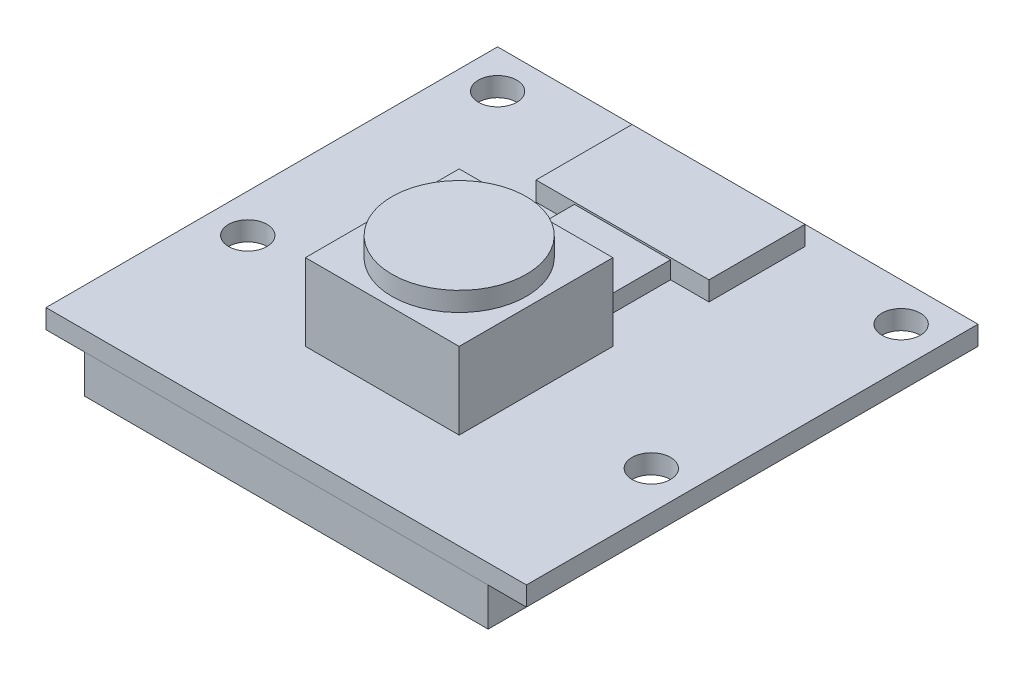
ISO-10303-21;
HEADER;
FILE_DESCRIPTION(('STEP AP214'),'2;1');
FILE_NAME('part.step','',(''),(''),'','','');
FILE_SCHEMA(('AUTOMOTIVE_DESIGN { 1 0 10303 214 1 1 1 1 }'));
ENDSEC;
DATA;
#1=APPLICATION_CONTEXT('core data for automotive mechanical design processes');
#2=APPLICATION_PROTOCOL_DEFINITION('international standard','automotive_design',2000,#1);
#3=PRODUCT_CONTEXT('',#1,'mechanical');
#4=PRODUCT('Part','Part','',(#3));
#5=PRODUCT_RELATED_PRODUCT_CATEGORY('part','',(#4));
#6=PRODUCT_DEFINITION_FORMATION('','',#4);
#7=PRODUCT_DEFINITION_CONTEXT('part definition',#1,'design');
#8=PRODUCT_DEFINITION('design','',#6,#7);
#9=PRODUCT_DEFINITION_SHAPE('','',#8);
#10=(LENGTH_UNIT() NAMED_UNIT(*) SI_UNIT(.MILLI.,.METRE.));
#11=(NAMED_UNIT(*) PLANE_ANGLE_UNIT() SI_UNIT($,.RADIAN.));
#12=(NAMED_UNIT(*) SI_UNIT($,.STERADIAN.) SOLID_ANGLE_UNIT());
#13=UNCERTAINTY_MEASURE_WITH_UNIT(LENGTH_MEASURE(1.E-05),#10,'distance_accuracy_value','');
#14=(GEOMETRIC_REPRESENTATION_CONTEXT(3) GLOBAL_UNCERTAINTY_ASSIGNED_CONTEXT((#13)) GLOBAL_UNIT_ASSIGNED_CONTEXT((#10,
#11,#12)) REPRESENTATION_CONTEXT('',''));
#15=CARTESIAN_POINT('',(0.,0.,0.));
#16=DIRECTION('',(0.,0.,1.));
#17=DIRECTION('',(1.,0.,0.));
#18=AXIS2_PLACEMENT_3D('',#15,#16,#17);
#19=CARTESIAN_POINT('',(0.,0.,0.));
#20=DIRECTION('',(0.,1.,0.));
#21=DIRECTION('',(0.,0.,1.));
#22=AXIS2_PLACEMENT_3D('',#19,#20,#21);
#23=PLANE('',#22);
#24=DIRECTION('',(0.,0.,-1.));
#25=VECTOR('',#24,1.);
#26=CARTESIAN_POINT('',(12.5,0.,-11.75));
#27=LINE('',#26,#25);
#28=CARTESIAN_POINT('',(12.5,0.,11.75));
#29=VERTEX_POINT('',#28);
#30=CARTESIAN_POINT('',(12.5,0.,-11.75));
#31=VERTEX_POINT('',#30);
#32=EDGE_CURVE('E310',#29,#31,#27,.T.);
#33=ORIENTED_EDGE('',*,*,#32,.F.);
#34=DIRECTION('',(1.,0.,0.));
#35=VECTOR('',#34,1.);
#36=CARTESIAN_POINT('',(-12.5,0.,11.75));
#37=LINE('',#36,#35);
#38=CARTESIAN_POINT('',(-12.5,0.,11.75));
#39=VERTEX_POINT('',#38);
#40=EDGE_CURVE('E317',#39,#29,#37,.T.);
#41=ORIENTED_EDGE('',*,*,#40,.F.);
#42=DIRECTION('',(0.,0.,1.));
#43=VECTOR('',#42,1.);
#44=CARTESIAN_POINT('',(-12.5,0.,-11.75));
#45=LINE('',#44,#43);
#46=CARTESIAN_POINT('',(-12.5,0.,-11.75));
#47=VERTEX_POINT('',#46);
#48=EDGE_CURVE('E328',#47,#39,#45,.T.);
#49=ORIENTED_EDGE('',*,*,#48,.F.);
#50=DIRECTION('',(-1.,0.,0.));
#51=VECTOR('',#50,1.);
#52=CARTESIAN_POINT('',(-12.5,0.,-11.75));
#53=LINE('',#52,#51);
#54=EDGE_CURVE('E326',#31,#47,#53,.T.);
#55=ORIENTED_EDGE('',*,*,#54,.F.);
#56=EDGE_LOOP('',(#33,#41,#49,#55));
#57=FACE_BOUND('',#56,.T.);
#58=CARTESIAN_POINT('',(-10.5,0.,-9.75));
#59=DIRECTION('',(0.,1.,0.));
#60=DIRECTION('',(0.,0.,1.));
#61=AXIS2_PLACEMENT_3D('',#58,#59,#60);
#62=CIRCLE('',#61,1.);
#63=CARTESIAN_POINT('',(-10.5,0.,-8.75));
#64=VERTEX_POINT('',#63);
#65=EDGE_CURVE('E307',#64,#64,#62,.T.);
#66=ORIENTED_EDGE('',*,*,#65,.T.);
#67=EDGE_LOOP('',(#66));
#68=FACE_BOUND('',#67,.T.);
#69=CARTESIAN_POINT('',(10.5,0.,-9.75));
#70=DIRECTION('',(0.,1.,0.));
#71=DIRECTION('',(0.,0.,1.));
#72=AXIS2_PLACEMENT_3D('',#69,#70,#71);
#73=CIRCLE('',#72,1.);
#74=CARTESIAN_POINT('',(10.5,0.,-8.75));
#75=VERTEX_POINT('',#74);
#76=EDGE_CURVE('E301',#75,#75,#73,.T.);
#77=ORIENTED_EDGE('',*,*,#76,.T.);
#78=EDGE_LOOP('',(#77));
#79=FACE_BOUND('',#78,.T.);
#80=CARTESIAN_POINT('',(10.5,0.,3.25));
#81=DIRECTION('',(0.,1.,0.));
#82=DIRECTION('',(0.,0.,1.));
#83=AXIS2_PLACEMENT_3D('',#80,#81,#82);
#84=CIRCLE('',#83,1.);
#85=CARTESIAN_POINT('',(10.5,0.,4.25));
#86=VERTEX_POINT('',#85);
#87=EDGE_CURVE('E295',#86,#86,#84,.T.);
#88=ORIENTED_EDGE('',*,*,#87,.T.);
#89=EDGE_LOOP('',(#88));
#90=FACE_BOUND('',#89,.T.);
#91=CARTESIAN_POINT('',(-10.5,0.,3.25));
#92=DIRECTION('',(0.,1.,0.));
#93=DIRECTION('',(0.,0.,1.));
#94=AXIS2_PLACEMENT_3D('',#91,#92,#93);
#95=CIRCLE('',#94,1.);
#96=CARTESIAN_POINT('',(-10.5,0.,4.25));
#97=VERTEX_POINT('',#96);
#98=EDGE_CURVE('E289',#97,#97,#95,.T.);
#99=ORIENTED_EDGE('',*,*,#98,.T.);
#100=EDGE_LOOP('',(#99));
#101=FACE_BOUND('',#100,.T.);
#102=DIRECTION('',(0.,0.,1.));
#103=VECTOR('',#102,1.);
#104=CARTESIAN_POINT('',(10.5,0.,11.74));
#105=LINE('',#104,#103);
#106=CARTESIAN_POINT('',(10.5,0.,6.74));
#107=VERTEX_POINT('',#106);
#108=CARTESIAN_POINT('',(10.5,0.,11.74));
#109=VERTEX_POINT('',#108);
#110=EDGE_CURVE('E189',#107,#109,#105,.T.);
#111=ORIENTED_EDGE('',*,*,#110,.F.);
#112=DIRECTION('',(1.,0.,0.));
#113=VECTOR('',#112,1.);
#114=CARTESIAN_POINT('',(-10.5,0.,6.74));
#115=LINE('',#114,#113);
#116=CARTESIAN_POINT('',(-10.5,0.,6.74));
#117=VERTEX_POINT('',#116);
#118=EDGE_CURVE('E186',#117,#107,#115,.T.);
#119=ORIENTED_EDGE('',*,*,#118,.F.);
#120=DIRECTION('',(0.,0.,-1.));
#121=VECTOR('',#120,1.);
#122=CARTESIAN_POINT('',(-10.5,0.,11.74));
#123=LINE('',#122,#121);
#124=CARTESIAN_POINT('',(-10.5,0.,11.74));
#125=VERTEX_POINT('',#124);
#126=EDGE_CURVE('E52',#125,#117,#123,.T.);
#127=ORIENTED_EDGE('',*,*,#126,.F.);
#128=DIRECTION('',(-1.,0.,0.));
#129=VECTOR('',#128,1.);
#130=CARTESIAN_POINT('',(-10.5,0.,11.74));
#131=LINE('',#130,#129);
#132=EDGE_CURVE('E47',#109,#125,#131,.T.);
#133=ORIENTED_EDGE('',*,*,#132,.F.);
#134=EDGE_LOOP('',(#111,#119,#127,#133));
#135=FACE_BOUND('',#134,.T.);
#136=ADVANCED_FACE('F32',(#57,#68,#79,#90,#101,#135),#23,.F.);
#137=CARTESIAN_POINT('',(0.,5.,0.));
#138=DIRECTION('',(0.,1.,0.));
#139=DIRECTION('',(0.,0.,1.));
#140=AXIS2_PLACEMENT_3D('',#137,#138,#139);
#141=PLANE('',#140);
#142=DIRECTION('',(0.,0.,-1.));
#143=VECTOR('',#142,1.);
#144=CARTESIAN_POINT('',(4.,5.,-1.25));
#145=LINE('',#144,#143);
#146=CARTESIAN_POINT('',(4.,5.,6.75));
#147=VERTEX_POINT('',#146);
#148=CARTESIAN_POINT('',(4.,5.,-1.25));
#149=VERTEX_POINT('',#148);
#150=EDGE_CURVE('E202',#147,#149,#145,.T.);
#151=ORIENTED_EDGE('',*,*,#150,.T.);
#152=DIRECTION('',(-1.,0.,0.));
#153=VECTOR('',#152,1.);
#154=CARTESIAN_POINT('',(-4.,5.,-1.25));
#155=LINE('',#154,#153);
#156=CARTESIAN_POINT('',(-4.,5.,-1.25));
#157=VERTEX_POINT('',#156);
#158=EDGE_CURVE('E205',#149,#157,#155,.T.);
#159=ORIENTED_EDGE('',*,*,#158,.T.);
#160=DIRECTION('',(0.,0.,1.));
#161=VECTOR('',#160,1.);
#162=CARTESIAN_POINT('',(-4.,5.,-1.25));
#163=LINE('',#162,#161);
#164=CARTESIAN_POINT('',(-4.,5.,6.75));
#165=VERTEX_POINT('',#164);
#166=EDGE_CURVE('E208',#157,#165,#163,.T.);
#167=ORIENTED_EDGE('',*,*,#166,.T.);
#168=DIRECTION('',(1.,0.,0.));
#169=VECTOR('',#168,1.);
#170=CARTESIAN_POINT('',(-4.,5.,6.75));
#171=LINE('',#170,#169);
#172=EDGE_CURVE('E210',#165,#147,#171,.T.);
#173=ORIENTED_EDGE('',*,*,#172,.T.);
#174=EDGE_LOOP('',(#151,#159,#167,#173));
#175=FACE_BOUND('',#174,.T.);
#176=CARTESIAN_POINT('',(0.,5.,2.75));
#177=DIRECTION('',(0.,1.,0.));
#178=DIRECTION('',(0.,0.,1.));
#179=AXIS2_PLACEMENT_3D('',#176,#177,#178);
#180=CIRCLE('',#179,3.5);
#181=CARTESIAN_POINT('',(0.,5.,6.25));
#182=VERTEX_POINT('',#181);
#183=EDGE_CURVE('E190',#182,#182,#180,.T.);
#184=ORIENTED_EDGE('',*,*,#183,.F.);
#185=EDGE_LOOP('',(#184));
#186=FACE_BOUND('',#185,.T.);
#187=ADVANCED_FACE('F366',(#175,#186),#141,.T.);
#188=CARTESIAN_POINT('',(0.,1.,0.));
#189=DIRECTION('',(0.,1.,0.));
#190=DIRECTION('',(0.,0.,1.));
#191=AXIS2_PLACEMENT_3D('',#188,#189,#190);
#192=PLANE('',#191);
#193=DIRECTION('',(0.,0.,-1.));
#194=VECTOR('',#193,1.);
#195=CARTESIAN_POINT('',(12.5,1.,-11.75));
#196=LINE('',#195,#194);
#197=CARTESIAN_POINT('',(12.5,1.,11.75));
#198=VERTEX_POINT('',#197);
#199=CARTESIAN_POINT('',(12.5,1.,-11.75));
#200=VERTEX_POINT('',#199);
#201=EDGE_CURVE('E313',#198,#200,#196,.T.);
#202=ORIENTED_EDGE('',*,*,#201,.T.);
#203=DIRECTION('',(-1.,0.,0.));
#204=VECTOR('',#203,1.);
#205=CARTESIAN_POINT('',(-12.5,1.,-11.75));
#206=LINE('',#205,#204);
#207=CARTESIAN_POINT('',(-12.5,1.,-11.75));
#208=VERTEX_POINT('',#207);
#209=EDGE_CURVE('E316',#200,#208,#206,.T.);
#210=ORIENTED_EDGE('',*,*,#209,.T.);
#211=DIRECTION('',(0.,0.,1.));
#212=VECTOR('',#211,1.);
#213=CARTESIAN_POINT('',(-12.5,1.,-11.75));
#214=LINE('',#213,#212);
#215=CARTESIAN_POINT('',(-12.5,1.,11.75));
#216=VERTEX_POINT('',#215);
#217=EDGE_CURVE('E319',#208,#216,#214,.T.);
#218=ORIENTED_EDGE('',*,*,#217,.T.);
#219=DIRECTION('',(1.,0.,0.));
#220=VECTOR('',#219,1.);
#221=CARTESIAN_POINT('',(-12.5,1.,11.75));
#222=LINE('',#221,#220);
#223=EDGE_CURVE('E321',#216,#198,#222,.T.);
#224=ORIENTED_EDGE('',*,*,#223,.T.);
#225=EDGE_LOOP('',(#202,#210,#218,#224));
#226=FACE_BOUND('',#225,.T.);
#227=CARTESIAN_POINT('',(-10.5,1.,-9.75));
#228=DIRECTION('',(0.,1.,0.));
#229=DIRECTION('',(0.,0.,1.));
#230=AXIS2_PLACEMENT_3D('',#227,#228,#229);
#231=CIRCLE('',#230,1.);
#232=CARTESIAN_POINT('',(-10.5,1.,-8.75));
#233=VERTEX_POINT('',#232);
#234=EDGE_CURVE('E304',#233,#233,#231,.T.);
#235=ORIENTED_EDGE('',*,*,#234,.F.);
#236=EDGE_LOOP('',(#235));
#237=FACE_BOUND('',#236,.T.);
#238=CARTESIAN_POINT('',(10.5,1.,-9.75));
#239=DIRECTION('',(0.,1.,0.));
#240=DIRECTION('',(0.,0.,1.));
#241=AXIS2_PLACEMENT_3D('',#238,#239,#240);
#242=CIRCLE('',#241,1.);
#243=CARTESIAN_POINT('',(10.5,1.,-8.75));
#244=VERTEX_POINT('',#243);
#245=EDGE_CURVE('E298',#244,#244,#242,.T.);
#246=ORIENTED_EDGE('',*,*,#245,.F.);
#247=EDGE_LOOP('',(#246));
#248=FACE_BOUND('',#247,.T.);
#249=CARTESIAN_POINT('',(10.5,1.,3.25));
#250=DIRECTION('',(0.,1.,0.));
#251=DIRECTION('',(0.,0.,1.));
#252=AXIS2_PLACEMENT_3D('',#249,#250,#251);
#253=CIRCLE('',#252,1.);
#254=CARTESIAN_POINT('',(10.5,1.,4.25));
#255=VERTEX_POINT('',#254);
#256=EDGE_CURVE('E292',#255,#255,#253,.T.);
#257=ORIENTED_EDGE('',*,*,#256,.F.);
#258=EDGE_LOOP('',(#257));
#259=FACE_BOUND('',#258,.T.);
#260=CARTESIAN_POINT('',(-10.5,1.,3.25));
#261=DIRECTION('',(0.,1.,0.));
#262=DIRECTION('',(0.,0.,1.));
#263=AXIS2_PLACEMENT_3D('',#260,#261,#262);
#264=CIRCLE('',#263,1.);
#265=CARTESIAN_POINT('',(-10.5,1.,4.25));
#266=VERTEX_POINT('',#265);
#267=EDGE_CURVE('E288',#266,#266,#264,.T.);
#268=ORIENTED_EDGE('',*,*,#267,.F.);
#269=EDGE_LOOP('',(#268));
#270=FACE_BOUND('',#269,.T.);
#271=DIRECTION('',(0.,0.,-1.));
#272=VECTOR('',#271,1.);
#273=CARTESIAN_POINT('',(2.5,1.,-5.75));
#274=LINE('',#273,#272);
#275=CARTESIAN_POINT('',(2.5,1.,-1.25));
#276=VERTEX_POINT('',#275);
#277=CARTESIAN_POINT('',(2.5,1.,-5.75));
#278=VERTEX_POINT('',#277);
#279=EDGE_CURVE('E231',#276,#278,#274,.T.);
#280=ORIENTED_EDGE('',*,*,#279,.F.);
#281=DIRECTION('',(-1.,0.,0.));
#282=VECTOR('',#281,1.);
#283=CARTESIAN_POINT('',(-4.,1.,-1.25));
#284=LINE('',#283,#282);
#285=CARTESIAN_POINT('',(4.,1.,-1.25));
#286=VERTEX_POINT('',#285);
#287=EDGE_CURVE('E216',#286,#276,#284,.T.);
#288=ORIENTED_EDGE('',*,*,#287,.F.);
#289=DIRECTION('',(0.,0.,-1.));
#290=VECTOR('',#289,1.);
#291=CARTESIAN_POINT('',(4.,1.,-1.25));
#292=LINE('',#291,#290);
#293=CARTESIAN_POINT('',(4.,1.,6.75));
#294=VERTEX_POINT('',#293);
#295=EDGE_CURVE('E200',#294,#286,#292,.T.);
#296=ORIENTED_EDGE('',*,*,#295,.F.);
#297=DIRECTION('',(1.,0.,0.));
#298=VECTOR('',#297,1.);
#299=CARTESIAN_POINT('',(-4.,1.,6.75));
#300=LINE('',#299,#298);
#301=CARTESIAN_POINT('',(-4.,1.,6.75));
#302=VERTEX_POINT('',#301);
#303=EDGE_CURVE('E206',#302,#294,#300,.T.);
#304=ORIENTED_EDGE('',*,*,#303,.F.);
#305=DIRECTION('',(0.,0.,1.));
#306=VECTOR('',#305,1.);
#307=CARTESIAN_POINT('',(-4.,1.,-1.25));
#308=LINE('',#307,#306);
#309=CARTESIAN_POINT('',(-4.,1.,-1.25));
#310=VERTEX_POINT('',#309);
#311=EDGE_CURVE('E218',#310,#302,#308,.T.);
#312=ORIENTED_EDGE('',*,*,#311,.F.);
#313=CARTESIAN_POINT('',(-2.5,1.,-1.25));
#314=VERTEX_POINT('',#313);
#315=EDGE_CURVE('E215',#314,#310,#284,.T.);
#316=ORIENTED_EDGE('',*,*,#315,.F.);
#317=DIRECTION('',(0.,0.,1.));
#318=VECTOR('',#317,1.);
#319=CARTESIAN_POINT('',(-2.5,1.,-5.75));
#320=LINE('',#319,#318);
#321=CARTESIAN_POINT('',(-2.5,1.,-5.75));
#322=VERTEX_POINT('',#321);
#323=EDGE_CURVE('E236',#322,#314,#320,.T.);
#324=ORIENTED_EDGE('',*,*,#323,.F.);
#325=DIRECTION('',(1.,0.,0.));
#326=VECTOR('',#325,1.);
#327=CARTESIAN_POINT('',(-4.5,1.,-5.75));
#328=LINE('',#327,#326);
#329=CARTESIAN_POINT('',(-4.5,1.,-5.75));
#330=VERTEX_POINT('',#329);
#331=EDGE_CURVE('E262',#330,#322,#328,.T.);
#332=ORIENTED_EDGE('',*,*,#331,.F.);
#333=DIRECTION('',(0.,0.,1.));
#334=VECTOR('',#333,1.);
#335=CARTESIAN_POINT('',(-4.5,1.,-10.75));
#336=LINE('',#335,#334);
#337=CARTESIAN_POINT('',(-4.5,1.,-10.75));
#338=VERTEX_POINT('',#337);
#339=EDGE_CURVE('E273',#338,#330,#336,.T.);
#340=ORIENTED_EDGE('',*,*,#339,.F.);
#341=DIRECTION('',(-1.,0.,0.));
#342=VECTOR('',#341,1.);
#343=CARTESIAN_POINT('',(-4.5,1.,-10.75));
#344=LINE('',#343,#342);
#345=CARTESIAN_POINT('',(4.5,1.,-10.75));
#346=VERTEX_POINT('',#345);
#347=EDGE_CURVE('E271',#346,#338,#344,.T.);
#348=ORIENTED_EDGE('',*,*,#347,.F.);
#349=DIRECTION('',(0.,0.,-1.));
#350=VECTOR('',#349,1.);
#351=CARTESIAN_POINT('',(4.5,1.,-10.75));
#352=LINE('',#351,#350);
#353=CARTESIAN_POINT('',(4.5,1.,-5.75));
#354=VERTEX_POINT('',#353);
#355=EDGE_CURVE('E257',#354,#346,#352,.T.);
#356=ORIENTED_EDGE('',*,*,#355,.F.);
#357=EDGE_CURVE('E276',#278,#354,#328,.T.);
#358=ORIENTED_EDGE('',*,*,#357,.F.);
#359=EDGE_LOOP('',(#280,#288,#296,#304,#312,#316,#324,#332,#340,#348,#356,#358));
#360=FACE_BOUND('',#359,.T.);
#361=ADVANCED_FACE('F355',(#226,#237,#248,#259,#270,#360),#192,.T.);
#362=CARTESIAN_POINT('',(-4.5,2.,-5.75));
#363=DIRECTION('',(0.,0.,-1.));
#364=DIRECTION('',(-1.,0.,0.));
#365=AXIS2_PLACEMENT_3D('',#362,#363,#364);
#366=PLANE('',#365);
#367=DIRECTION('',(0.,-1.,0.));
#368=VECTOR('',#367,1.);
#369=CARTESIAN_POINT('',(2.5,1.9,-5.75));
#370=LINE('',#369,#368);
#371=CARTESIAN_POINT('',(2.5,1.9,-5.75));
#372=VERTEX_POINT('',#371);
#373=EDGE_CURVE('E254',#372,#278,#370,.T.);
#374=ORIENTED_EDGE('',*,*,#373,.T.);
#375=ORIENTED_EDGE('',*,*,#357,.T.);
#376=DIRECTION('',(0.,-1.,0.));
#377=VECTOR('',#376,1.);
#378=CARTESIAN_POINT('',(4.5,2.,-5.75));
#379=LINE('',#378,#377);
#380=CARTESIAN_POINT('',(4.5,2.,-5.75));
#381=VERTEX_POINT('',#380);
#382=EDGE_CURVE('E268',#381,#354,#379,.T.);
#383=ORIENTED_EDGE('',*,*,#382,.F.);
#384=DIRECTION('',(1.,0.,0.));
#385=VECTOR('',#384,1.);
#386=CARTESIAN_POINT('',(-4.5,2.,-5.75));
#387=LINE('',#386,#385);
#388=CARTESIAN_POINT('',(-4.5,2.,-5.75));
#389=VERTEX_POINT('',#388);
#390=EDGE_CURVE('E266',#389,#381,#387,.T.);
#391=ORIENTED_EDGE('',*,*,#390,.F.);
#392=DIRECTION('',(0.,-1.,0.));
#393=VECTOR('',#392,1.);
#394=CARTESIAN_POINT('',(-4.5,2.,-5.75));
#395=LINE('',#394,#393);
#396=EDGE_CURVE('E281',#389,#330,#395,.T.);
#397=ORIENTED_EDGE('',*,*,#396,.T.);
#398=ORIENTED_EDGE('',*,*,#331,.T.);
#399=DIRECTION('',(0.,-1.,0.));
#400=VECTOR('',#399,1.);
#401=CARTESIAN_POINT('',(-2.5,1.9,-5.75));
#402=LINE('',#401,#400);
#403=CARTESIAN_POINT('',(-2.5,1.9,-5.75));
#404=VERTEX_POINT('',#403);
#405=EDGE_CURVE('E252',#404,#322,#402,.T.);
#406=ORIENTED_EDGE('',*,*,#405,.F.);
#407=DIRECTION('',(-1.,0.,0.));
#408=VECTOR('',#407,1.);
#409=CARTESIAN_POINT('',(-2.5,1.9,-5.75));
#410=LINE('',#409,#408);
#411=EDGE_CURVE('E235',#372,#404,#410,.T.);
#412=ORIENTED_EDGE('',*,*,#411,.F.);
#413=EDGE_LOOP('',(#374,#375,#383,#391,#397,#398,#406,#412));
#414=FACE_BOUND('',#413,.T.);
#415=ADVANCED_FACE('F364',(#414),#366,.F.);
#416=CARTESIAN_POINT('',(12.5,1.,-11.75));
#417=DIRECTION('',(-1.,0.,0.));
#418=DIRECTION('',(0.,0.,1.));
#419=AXIS2_PLACEMENT_3D('',#416,#417,#418);
#420=PLANE('',#419);
#421=ORIENTED_EDGE('',*,*,#32,.T.);
#422=DIRECTION('',(0.,-1.,0.));
#423=VECTOR('',#422,1.);
#424=CARTESIAN_POINT('',(12.5,1.,-11.75));
#425=LINE('',#424,#423);
#426=EDGE_CURVE('E11',#200,#31,#425,.T.);
#427=ORIENTED_EDGE('',*,*,#426,.F.);
#428=ORIENTED_EDGE('',*,*,#201,.F.);
#429=DIRECTION('',(0.,-1.,0.));
#430=VECTOR('',#429,1.);
#431=CARTESIAN_POINT('',(12.5,1.,11.75));
#432=LINE('',#431,#430);
#433=EDGE_CURVE('E323',#198,#29,#432,.T.);
#434=ORIENTED_EDGE('',*,*,#433,.T.);
#435=EDGE_LOOP('',(#421,#427,#428,#434));
#436=FACE_BOUND('',#435,.T.);
#437=ADVANCED_FACE('F34',(#436),#420,.F.);
#438=CARTESIAN_POINT('',(-12.5,1.,-11.75));
#439=DIRECTION('',(0.,0.,1.));
#440=DIRECTION('',(1.,0.,0.));
#441=AXIS2_PLACEMENT_3D('',#438,#439,#440);
#442=PLANE('',#441);
#443=ORIENTED_EDGE('',*,*,#54,.T.);
#444=DIRECTION('',(0.,-1.,0.));
#445=VECTOR('',#444,1.);
#446=CARTESIAN_POINT('',(-12.5,1.,-11.75));
#447=LINE('',#446,#445);
#448=EDGE_CURVE('E40',#208,#47,#447,.T.);
#449=ORIENTED_EDGE('',*,*,#448,.F.);
#450=ORIENTED_EDGE('',*,*,#209,.F.);
#451=ORIENTED_EDGE('',*,*,#426,.T.);
#452=EDGE_LOOP('',(#443,#449,#450,#451));
#453=FACE_BOUND('',#452,.T.);
#454=ADVANCED_FACE('F357',(#453),#442,.F.);
#455=CARTESIAN_POINT('',(-12.5,1.,-11.75));
#456=DIRECTION('',(1.,0.,0.));
#457=DIRECTION('',(0.,0.,-1.));
#458=AXIS2_PLACEMENT_3D('',#455,#456,#457);
#459=PLANE('',#458);
#460=ORIENTED_EDGE('',*,*,#48,.T.);
#461=DIRECTION('',(0.,-1.,0.));
#462=VECTOR('',#461,1.);
#463=CARTESIAN_POINT('',(-12.5,1.,11.75));
#464=LINE('',#463,#462);
#465=EDGE_CURVE('E333',#216,#39,#464,.T.);
#466=ORIENTED_EDGE('',*,*,#465,.F.);
#467=ORIENTED_EDGE('',*,*,#217,.F.);
#468=ORIENTED_EDGE('',*,*,#448,.T.);
#469=EDGE_LOOP('',(#460,#466,#467,#468));
#470=FACE_BOUND('',#469,.T.);
#471=ADVANCED_FACE('F340',(#470),#459,.F.);
#472=CARTESIAN_POINT('',(-12.5,1.,11.75));
#473=DIRECTION('',(0.,0.,-1.));
#474=DIRECTION('',(-1.,0.,0.));
#475=AXIS2_PLACEMENT_3D('',#472,#473,#474);
#476=PLANE('',#475);
#477=ORIENTED_EDGE('',*,*,#40,.T.);
#478=ORIENTED_EDGE('',*,*,#433,.F.);
#479=ORIENTED_EDGE('',*,*,#223,.F.);
#480=ORIENTED_EDGE('',*,*,#465,.T.);
#481=EDGE_LOOP('',(#477,#478,#479,#480));
#482=FACE_BOUND('',#481,.T.);
#483=ADVANCED_FACE('F349',(#482),#476,.F.);
#484=CARTESIAN_POINT('',(-10.5,0.,-9.75));
#485=DIRECTION('',(0.,1.,0.));
#486=DIRECTION('',(0.,0.,1.));
#487=AXIS2_PLACEMENT_3D('',#484,#485,#486);
#488=CYLINDRICAL_SURFACE('',#487,1.);
#489=ORIENTED_EDGE('',*,*,#65,.F.);
#490=EDGE_LOOP('',(#489));
#491=FACE_BOUND('',#490,.T.);
#492=ORIENTED_EDGE('',*,*,#234,.T.);
#493=EDGE_LOOP('',(#492));
#494=FACE_BOUND('',#493,.T.);
#495=ADVANCED_FACE('F377',(#491,#494),#488,.F.);
#496=CARTESIAN_POINT('',(10.5,0.,-9.75));
#497=DIRECTION('',(0.,1.,0.));
#498=DIRECTION('',(0.,0.,1.));
#499=AXIS2_PLACEMENT_3D('',#496,#497,#498);
#500=CYLINDRICAL_SURFACE('',#499,1.);
#501=ORIENTED_EDGE('',*,*,#76,.F.);
#502=EDGE_LOOP('',(#501));
#503=FACE_BOUND('',#502,.T.);
#504=ORIENTED_EDGE('',*,*,#245,.T.);
#505=EDGE_LOOP('',(#504));
#506=FACE_BOUND('',#505,.T.);
#507=ADVANCED_FACE('F381',(#503,#506),#500,.F.);
#508=CARTESIAN_POINT('',(10.5,0.,3.25));
#509=DIRECTION('',(0.,1.,0.));
#510=DIRECTION('',(0.,0.,1.));
#511=AXIS2_PLACEMENT_3D('',#508,#509,#510);
#512=CYLINDRICAL_SURFACE('',#511,1.);
#513=ORIENTED_EDGE('',*,*,#87,.F.);
#514=EDGE_LOOP('',(#513));
#515=FACE_BOUND('',#514,.T.);
#516=ORIENTED_EDGE('',*,*,#256,.T.);
#517=EDGE_LOOP('',(#516));
#518=FACE_BOUND('',#517,.T.);
#519=ADVANCED_FACE('F386',(#515,#518),#512,.F.);
#520=CARTESIAN_POINT('',(-10.5,0.,3.25));
#521=DIRECTION('',(0.,1.,0.));
#522=DIRECTION('',(0.,0.,1.));
#523=AXIS2_PLACEMENT_3D('',#520,#521,#522);
#524=CYLINDRICAL_SURFACE('',#523,1.);
#525=ORIENTED_EDGE('',*,*,#98,.F.);
#526=EDGE_LOOP('',(#525));
#527=FACE_BOUND('',#526,.T.);
#528=ORIENTED_EDGE('',*,*,#267,.T.);
#529=EDGE_LOOP('',(#528));
#530=FACE_BOUND('',#529,.T.);
#531=ADVANCED_FACE('F394',(#527,#530),#524,.F.);
#532=CARTESIAN_POINT('',(4.5,2.,-10.75));
#533=DIRECTION('',(-1.,0.,0.));
#534=DIRECTION('',(0.,0.,1.));
#535=AXIS2_PLACEMENT_3D('',#532,#533,#534);
#536=PLANE('',#535);
#537=ORIENTED_EDGE('',*,*,#355,.T.);
#538=DIRECTION('',(0.,-1.,0.));
#539=VECTOR('',#538,1.);
#540=CARTESIAN_POINT('',(4.5,2.,-10.75));
#541=LINE('',#540,#539);
#542=CARTESIAN_POINT('',(4.5,2.,-10.75));
#543=VERTEX_POINT('',#542);
#544=EDGE_CURVE('E286',#543,#346,#541,.T.);
#545=ORIENTED_EDGE('',*,*,#544,.F.);
#546=DIRECTION('',(0.,0.,-1.));
#547=VECTOR('',#546,1.);
#548=CARTESIAN_POINT('',(4.5,2.,-10.75));
#549=LINE('',#548,#547);
#550=EDGE_CURVE('E258',#381,#543,#549,.T.);
#551=ORIENTED_EDGE('',*,*,#550,.F.);
#552=ORIENTED_EDGE('',*,*,#382,.T.);
#553=EDGE_LOOP('',(#537,#545,#551,#552));
#554=FACE_BOUND('',#553,.T.);
#555=ADVANCED_FACE('F398',(#554),#536,.F.);
#556=CARTESIAN_POINT('',(-4.5,2.,-10.75));
#557=DIRECTION('',(0.,0.,1.));
#558=DIRECTION('',(1.,0.,0.));
#559=AXIS2_PLACEMENT_3D('',#556,#557,#558);
#560=PLANE('',#559);
#561=ORIENTED_EDGE('',*,*,#347,.T.);
#562=DIRECTION('',(0.,-1.,0.));
#563=VECTOR('',#562,1.);
#564=CARTESIAN_POINT('',(-4.5,2.,-10.75));
#565=LINE('',#564,#563);
#566=CARTESIAN_POINT('',(-4.5,2.,-10.75));
#567=VERTEX_POINT('',#566);
#568=EDGE_CURVE('E283',#567,#338,#565,.T.);
#569=ORIENTED_EDGE('',*,*,#568,.F.);
#570=DIRECTION('',(-1.,0.,0.));
#571=VECTOR('',#570,1.);
#572=CARTESIAN_POINT('',(-4.5,2.,-10.75));
#573=LINE('',#572,#571);
#574=EDGE_CURVE('E261',#543,#567,#573,.T.);
#575=ORIENTED_EDGE('',*,*,#574,.F.);
#576=ORIENTED_EDGE('',*,*,#544,.T.);
#577=EDGE_LOOP('',(#561,#569,#575,#576));
#578=FACE_BOUND('',#577,.T.);
#579=ADVANCED_FACE('F402',(#578),#560,.F.);
#580=CARTESIAN_POINT('',(-4.5,2.,-10.75));
#581=DIRECTION('',(1.,0.,0.));
#582=DIRECTION('',(0.,0.,-1.));
#583=AXIS2_PLACEMENT_3D('',#580,#581,#582);
#584=PLANE('',#583);
#585=ORIENTED_EDGE('',*,*,#339,.T.);
#586=ORIENTED_EDGE('',*,*,#396,.F.);
#587=DIRECTION('',(0.,0.,1.));
#588=VECTOR('',#587,1.);
#589=CARTESIAN_POINT('',(-4.5,2.,-10.75));
#590=LINE('',#589,#588);
#591=EDGE_CURVE('E264',#567,#389,#590,.T.);
#592=ORIENTED_EDGE('',*,*,#591,.F.);
#593=ORIENTED_EDGE('',*,*,#568,.T.);
#594=EDGE_LOOP('',(#585,#586,#592,#593));
#595=FACE_BOUND('',#594,.T.);
#596=ADVANCED_FACE('F406',(#595),#584,.F.);
#597=CARTESIAN_POINT('',(0.,2.,0.));
#598=DIRECTION('',(0.,1.,0.));
#599=DIRECTION('',(0.,0.,1.));
#600=AXIS2_PLACEMENT_3D('',#597,#598,#599);
#601=PLANE('',#600);
#602=ORIENTED_EDGE('',*,*,#550,.T.);
#603=ORIENTED_EDGE('',*,*,#574,.T.);
#604=ORIENTED_EDGE('',*,*,#591,.T.);
#605=ORIENTED_EDGE('',*,*,#390,.T.);
#606=EDGE_LOOP('',(#602,#603,#604,#605));
#607=FACE_BOUND('',#606,.T.);
#608=ADVANCED_FACE('F410',(#607),#601,.T.);
#609=CARTESIAN_POINT('',(2.5,1.9,-5.75));
#610=DIRECTION('',(-1.,0.,0.));
#611=DIRECTION('',(0.,0.,1.));
#612=AXIS2_PLACEMENT_3D('',#609,#610,#611);
#613=PLANE('',#612);
#614=ORIENTED_EDGE('',*,*,#279,.T.);
#615=ORIENTED_EDGE('',*,*,#373,.F.);
#616=DIRECTION('',(0.,0.,-1.));
#617=VECTOR('',#616,1.);
#618=CARTESIAN_POINT('',(2.5,1.9,-5.75));
#619=LINE('',#618,#617);
#620=CARTESIAN_POINT('',(2.5,1.9,-1.25));
#621=VERTEX_POINT('',#620);
#622=EDGE_CURVE('E232',#621,#372,#619,.T.);
#623=ORIENTED_EDGE('',*,*,#622,.F.);
#624=DIRECTION('',(0.,-1.,0.));
#625=VECTOR('',#624,1.);
#626=CARTESIAN_POINT('',(2.5,1.9,-1.25));
#627=LINE('',#626,#625);
#628=EDGE_CURVE('E244',#621,#276,#627,.T.);
#629=ORIENTED_EDGE('',*,*,#628,.T.);
#630=EDGE_LOOP('',(#614,#615,#623,#629));
#631=FACE_BOUND('',#630,.T.);
#632=ADVANCED_FACE('F417',(#631),#613,.F.);
#633=CARTESIAN_POINT('',(-2.5,1.9,-5.75));
#634=DIRECTION('',(1.,0.,0.));
#635=DIRECTION('',(0.,0.,-1.));
#636=AXIS2_PLACEMENT_3D('',#633,#634,#635);
#637=PLANE('',#636);
#638=ORIENTED_EDGE('',*,*,#323,.T.);
#639=DIRECTION('',(0.,-1.,0.));
#640=VECTOR('',#639,1.);
#641=CARTESIAN_POINT('',(-2.5,1.9,-1.25));
#642=LINE('',#641,#640);
#643=CARTESIAN_POINT('',(-2.5,1.9,-1.25));
#644=VERTEX_POINT('',#643);
#645=EDGE_CURVE('E250',#644,#314,#642,.T.);
#646=ORIENTED_EDGE('',*,*,#645,.F.);
#647=DIRECTION('',(0.,0.,1.));
#648=VECTOR('',#647,1.);
#649=CARTESIAN_POINT('',(-2.5,1.9,-5.75));
#650=LINE('',#649,#648);
#651=EDGE_CURVE('E238',#404,#644,#650,.T.);
#652=ORIENTED_EDGE('',*,*,#651,.F.);
#653=ORIENTED_EDGE('',*,*,#405,.T.);
#654=EDGE_LOOP('',(#638,#646,#652,#653));
#655=FACE_BOUND('',#654,.T.);
#656=ADVANCED_FACE('F421',(#655),#637,.F.);
#657=CARTESIAN_POINT('',(0.,1.9,0.));
#658=DIRECTION('',(0.,1.,0.));
#659=DIRECTION('',(0.,0.,1.));
#660=AXIS2_PLACEMENT_3D('',#657,#658,#659);
#661=PLANE('',#660);
#662=ORIENTED_EDGE('',*,*,#622,.T.);
#663=ORIENTED_EDGE('',*,*,#411,.T.);
#664=ORIENTED_EDGE('',*,*,#651,.T.);
#665=DIRECTION('',(1.,0.,0.));
#666=VECTOR('',#665,1.);
#667=CARTESIAN_POINT('',(-2.5,1.9,-1.25));
#668=LINE('',#667,#666);
#669=EDGE_CURVE('E241',#644,#621,#668,.T.);
#670=ORIENTED_EDGE('',*,*,#669,.T.);
#671=EDGE_LOOP('',(#662,#663,#664,#670));
#672=FACE_BOUND('',#671,.T.);
#673=ADVANCED_FACE('F425',(#672),#661,.T.);
#674=CARTESIAN_POINT('',(-4.,5.,-1.25));
#675=DIRECTION('',(0.,0.,1.));
#676=DIRECTION('',(1.,0.,0.));
#677=AXIS2_PLACEMENT_3D('',#674,#675,#676);
#678=PLANE('',#677);
#679=ORIENTED_EDGE('',*,*,#287,.T.);
#680=ORIENTED_EDGE('',*,*,#628,.F.);
#681=ORIENTED_EDGE('',*,*,#669,.F.);
#682=ORIENTED_EDGE('',*,*,#645,.T.);
#683=ORIENTED_EDGE('',*,*,#315,.T.);
#684=DIRECTION('',(0.,-1.,0.));
#685=VECTOR('',#684,1.);
#686=CARTESIAN_POINT('',(-4.,5.,-1.25));
#687=LINE('',#686,#685);
#688=EDGE_CURVE('E226',#157,#310,#687,.T.);
#689=ORIENTED_EDGE('',*,*,#688,.F.);
#690=ORIENTED_EDGE('',*,*,#158,.F.);
#691=DIRECTION('',(0.,-1.,0.));
#692=VECTOR('',#691,1.);
#693=CARTESIAN_POINT('',(4.,5.,-1.25));
#694=LINE('',#693,#692);
#695=EDGE_CURVE('E229',#149,#286,#694,.T.);
#696=ORIENTED_EDGE('',*,*,#695,.T.);
#697=EDGE_LOOP('',(#679,#680,#681,#682,#683,#689,#690,#696));
#698=FACE_BOUND('',#697,.T.);
#699=ADVANCED_FACE('F429',(#698),#678,.F.);
#700=CARTESIAN_POINT('',(4.,5.,-1.25));
#701=DIRECTION('',(-1.,0.,0.));
#702=DIRECTION('',(0.,0.,1.));
#703=AXIS2_PLACEMENT_3D('',#700,#701,#702);
#704=PLANE('',#703);
#705=ORIENTED_EDGE('',*,*,#295,.T.);
#706=ORIENTED_EDGE('',*,*,#695,.F.);
#707=ORIENTED_EDGE('',*,*,#150,.F.);
#708=DIRECTION('',(0.,-1.,0.));
#709=VECTOR('',#708,1.);
#710=CARTESIAN_POINT('',(4.,5.,6.75));
#711=LINE('',#710,#709);
#712=EDGE_CURVE('E212',#147,#294,#711,.T.);
#713=ORIENTED_EDGE('',*,*,#712,.T.);
#714=EDGE_LOOP('',(#705,#706,#707,#713));
#715=FACE_BOUND('',#714,.T.);
#716=ADVANCED_FACE('F431',(#715),#704,.F.);
#717=CARTESIAN_POINT('',(-4.,5.,-1.25));
#718=DIRECTION('',(1.,0.,0.));
#719=DIRECTION('',(0.,0.,-1.));
#720=AXIS2_PLACEMENT_3D('',#717,#718,#719);
#721=PLANE('',#720);
#722=ORIENTED_EDGE('',*,*,#311,.T.);
#723=DIRECTION('',(0.,-1.,0.));
#724=VECTOR('',#723,1.);
#725=CARTESIAN_POINT('',(-4.,5.,6.75));
#726=LINE('',#725,#724);
#727=EDGE_CURVE('E223',#165,#302,#726,.T.);
#728=ORIENTED_EDGE('',*,*,#727,.F.);
#729=ORIENTED_EDGE('',*,*,#166,.F.);
#730=ORIENTED_EDGE('',*,*,#688,.T.);
#731=EDGE_LOOP('',(#722,#728,#729,#730));
#732=FACE_BOUND('',#731,.T.);
#733=ADVANCED_FACE('F434',(#732),#721,.F.);
#734=CARTESIAN_POINT('',(-4.,5.,6.75));
#735=DIRECTION('',(0.,0.,-1.));
#736=DIRECTION('',(-1.,0.,0.));
#737=AXIS2_PLACEMENT_3D('',#734,#735,#736);
#738=PLANE('',#737);
#739=ORIENTED_EDGE('',*,*,#303,.T.);
#740=ORIENTED_EDGE('',*,*,#712,.F.);
#741=ORIENTED_EDGE('',*,*,#172,.F.);
#742=ORIENTED_EDGE('',*,*,#727,.T.);
#743=EDGE_LOOP('',(#739,#740,#741,#742));
#744=FACE_BOUND('',#743,.T.);
#745=ADVANCED_FACE('F441',(#744),#738,.F.);
#746=CARTESIAN_POINT('',(0.,6.,2.75));
#747=DIRECTION('',(0.,-1.,0.));
#748=DIRECTION('',(0.,0.,-1.));
#749=AXIS2_PLACEMENT_3D('',#746,#747,#748);
#750=CYLINDRICAL_SURFACE('',#749,3.5);
#751=CARTESIAN_POINT('',(0.,6.,2.75));
#752=DIRECTION('',(0.,1.,0.));
#753=DIRECTION('',(0.,0.,1.));
#754=AXIS2_PLACEMENT_3D('',#751,#752,#753);
#755=CIRCLE('',#754,3.5);
#756=CARTESIAN_POINT('',(0.,6.,6.25));
#757=VERTEX_POINT('',#756);
#758=EDGE_CURVE('E193',#757,#757,#755,.T.);
#759=ORIENTED_EDGE('',*,*,#758,.F.);
#760=EDGE_LOOP('',(#759));
#761=FACE_BOUND('',#760,.T.);
#762=ORIENTED_EDGE('',*,*,#183,.T.);
#763=EDGE_LOOP('',(#762));
#764=FACE_BOUND('',#763,.T.);
#765=ADVANCED_FACE('F444',(#761,#764),#750,.T.);
#766=CARTESIAN_POINT('',(0.,6.,2.75));
#767=DIRECTION('',(0.,1.,0.));
#768=DIRECTION('',(0.,0.,1.));
#769=AXIS2_PLACEMENT_3D('',#766,#767,#768);
#770=PLANE('',#769);
#771=ORIENTED_EDGE('',*,*,#758,.T.);
#772=EDGE_LOOP('',(#771));
#773=FACE_BOUND('',#772,.T.);
#774=ADVANCED_FACE('F449',(#773),#770,.T.);
#775=CARTESIAN_POINT('',(10.5,-2.,11.74));
#776=DIRECTION('',(-1.,0.,0.));
#777=DIRECTION('',(0.,0.,1.));
#778=AXIS2_PLACEMENT_3D('',#775,#776,#777);
#779=PLANE('',#778);
#780=ORIENTED_EDGE('',*,*,#110,.T.);
#781=DIRECTION('',(0.,1.,0.));
#782=VECTOR('',#781,1.);
#783=CARTESIAN_POINT('',(10.5,-2.,11.74));
#784=LINE('',#783,#782);
#785=CARTESIAN_POINT('',(10.5,-2.,11.74));
#786=VERTEX_POINT('',#785);
#787=EDGE_CURVE('E170',#786,#109,#784,.T.);
#788=ORIENTED_EDGE('',*,*,#787,.F.);
#789=DIRECTION('',(0.,0.,1.));
#790=VECTOR('',#789,1.);
#791=CARTESIAN_POINT('',(10.5,-2.,11.74));
#792=LINE('',#791,#790);
#793=CARTESIAN_POINT('',(10.5,-2.,6.74));
#794=VERTEX_POINT('',#793);
#795=EDGE_CURVE('E177',#794,#786,#792,.T.);
#796=ORIENTED_EDGE('',*,*,#795,.F.);
#797=DIRECTION('',(0.,1.,0.));
#798=VECTOR('',#797,1.);
#799=CARTESIAN_POINT('',(10.5,-2.,6.74));
#800=LINE('',#799,#798);
#801=EDGE_CURVE('E642',#794,#107,#800,.T.);
#802=ORIENTED_EDGE('',*,*,#801,.T.);
#803=EDGE_LOOP('',(#780,#788,#796,#802));
#804=FACE_BOUND('',#803,.T.);
#805=ADVANCED_FACE('F188',(#804),#779,.F.);
#806=CARTESIAN_POINT('',(-10.5,-2.,11.74));
#807=DIRECTION('',(0.,0.,-1.));
#808=DIRECTION('',(-1.,0.,0.));
#809=AXIS2_PLACEMENT_3D('',#806,#807,#808);
#810=PLANE('',#809);
#811=ORIENTED_EDGE('',*,*,#132,.T.);
#812=DIRECTION('',(0.,1.,0.));
#813=VECTOR('',#812,1.);
#814=CARTESIAN_POINT('',(-10.5,-2.,11.74));
#815=LINE('',#814,#813);
#816=CARTESIAN_POINT('',(-10.5,-2.,11.74));
#817=VERTEX_POINT('',#816);
#818=EDGE_CURVE('E173',#817,#125,#815,.T.);
#819=ORIENTED_EDGE('',*,*,#818,.F.);
#820=DIRECTION('',(-1.,0.,0.));
#821=VECTOR('',#820,1.);
#822=CARTESIAN_POINT('',(-10.5,-2.,11.74));
#823=LINE('',#822,#821);
#824=EDGE_CURVE('E166',#786,#817,#823,.T.);
#825=ORIENTED_EDGE('',*,*,#824,.F.);
#826=ORIENTED_EDGE('',*,*,#787,.T.);
#827=EDGE_LOOP('',(#811,#819,#825,#826));
#828=FACE_BOUND('',#827,.T.);
#829=ADVANCED_FACE('F168',(#828),#810,.F.);
#830=CARTESIAN_POINT('',(-10.5,-2.,11.74));
#831=DIRECTION('',(1.,0.,0.));
#832=DIRECTION('',(0.,0.,-1.));
#833=AXIS2_PLACEMENT_3D('',#830,#831,#832);
#834=PLANE('',#833);
#835=ORIENTED_EDGE('',*,*,#126,.T.);
#836=DIRECTION('',(0.,1.,0.));
#837=VECTOR('',#836,1.);
#838=CARTESIAN_POINT('',(-10.5,-2.,6.74));
#839=LINE('',#838,#837);
#840=CARTESIAN_POINT('',(-10.5,-2.,6.74));
#841=VERTEX_POINT('',#840);
#842=EDGE_CURVE('E195',#841,#117,#839,.T.);
#843=ORIENTED_EDGE('',*,*,#842,.F.);
#844=DIRECTION('',(0.,0.,-1.));
#845=VECTOR('',#844,1.);
#846=CARTESIAN_POINT('',(-10.5,-2.,11.74));
#847=LINE('',#846,#845);
#848=EDGE_CURVE('E176',#817,#841,#847,.T.);
#849=ORIENTED_EDGE('',*,*,#848,.F.);
#850=ORIENTED_EDGE('',*,*,#818,.T.);
#851=EDGE_LOOP('',(#835,#843,#849,#850));
#852=FACE_BOUND('',#851,.T.);
#853=ADVANCED_FACE('F458',(#852),#834,.F.);
#854=CARTESIAN_POINT('',(-10.5,-2.,6.74));
#855=DIRECTION('',(0.,0.,1.));
#856=DIRECTION('',(1.,0.,0.));
#857=AXIS2_PLACEMENT_3D('',#854,#855,#856);
#858=PLANE('',#857);
#859=ORIENTED_EDGE('',*,*,#118,.T.);
#860=ORIENTED_EDGE('',*,*,#801,.F.);
#861=DIRECTION('',(1.,0.,0.));
#862=VECTOR('',#861,1.);
#863=CARTESIAN_POINT('',(-10.5,-2.,6.74));
#864=LINE('',#863,#862);
#865=EDGE_CURVE('E182',#841,#794,#864,.T.);
#866=ORIENTED_EDGE('',*,*,#865,.F.);
#867=ORIENTED_EDGE('',*,*,#842,.T.);
#868=EDGE_LOOP('',(#859,#860,#866,#867));
#869=FACE_BOUND('',#868,.T.);
#870=ADVANCED_FACE('F461',(#869),#858,.F.);
#871=CARTESIAN_POINT('',(0.,-2.,0.));
#872=DIRECTION('',(0.,-1.,0.));
#873=DIRECTION('',(0.,0.,-1.));
#874=AXIS2_PLACEMENT_3D('',#871,#872,#873);
#875=PLANE('',#874);
#876=ORIENTED_EDGE('',*,*,#795,.T.);
#877=ORIENTED_EDGE('',*,*,#824,.T.);
#878=ORIENTED_EDGE('',*,*,#848,.T.);
#879=ORIENTED_EDGE('',*,*,#865,.T.);
#880=EDGE_LOOP('',(#876,#877,#878,#879));
#881=FACE_BOUND('',#880,.T.);
#882=ADVANCED_FACE('F180',(#881),#875,.T.);
#883=CLOSED_SHELL('',(#136,#187,#361,#415,#437,#454,#471,#483,#495,#507,#519,#531,#555,#579,
#596,#608,#632,#656,#673,#699,#716,#733,#745,#765,#774,#805,#829,#853,#870,#882));
#884=MANIFOLD_SOLID_BREP('B2',#883);
#885=ADVANCED_BREP_SHAPE_REPRESENTATION('',(#18,#884),#14);
#886=SHAPE_DEFINITION_REPRESENTATION(#9,#885);
ENDSEC;
END-ISO-10303-21;
